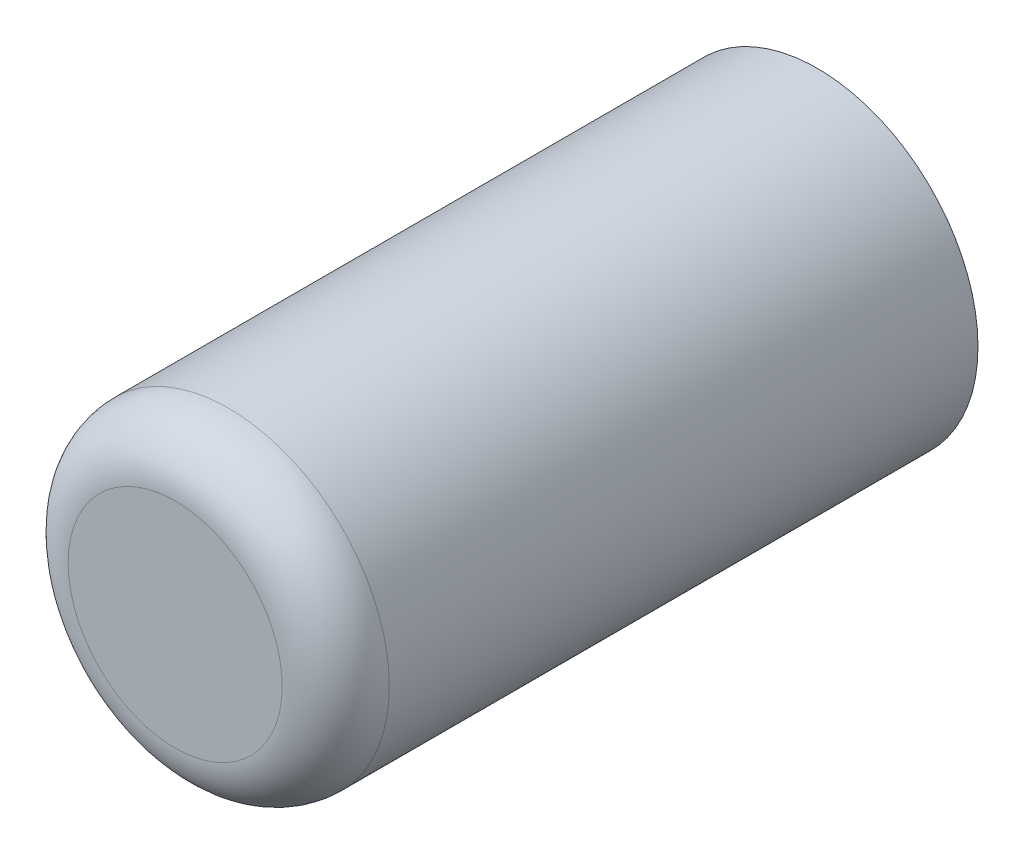
ISO-10303-21;
HEADER;
FILE_DESCRIPTION(('STEP AP214'),'2;1');
FILE_NAME('part.step','',(''),(''),'','','');
FILE_SCHEMA(('AUTOMOTIVE_DESIGN { 1 0 10303 214 1 1 1 1 }'));
ENDSEC;
DATA;
#1=APPLICATION_CONTEXT('core data for automotive mechanical design processes');
#2=APPLICATION_PROTOCOL_DEFINITION('international standard','automotive_design',2000,#1);
#3=PRODUCT_CONTEXT('',#1,'mechanical');
#4=PRODUCT('Part','Part','',(#3));
#5=PRODUCT_RELATED_PRODUCT_CATEGORY('part','',(#4));
#6=PRODUCT_DEFINITION_FORMATION('','',#4);
#7=PRODUCT_DEFINITION_CONTEXT('part definition',#1,'design');
#8=PRODUCT_DEFINITION('design','',#6,#7);
#9=PRODUCT_DEFINITION_SHAPE('','',#8);
#10=(LENGTH_UNIT() NAMED_UNIT(*) SI_UNIT(.MILLI.,.METRE.));
#11=(NAMED_UNIT(*) PLANE_ANGLE_UNIT() SI_UNIT($,.RADIAN.));
#12=(NAMED_UNIT(*) SI_UNIT($,.STERADIAN.) SOLID_ANGLE_UNIT());
#13=UNCERTAINTY_MEASURE_WITH_UNIT(LENGTH_MEASURE(1.E-05),#10,'distance_accuracy_value','');
#14=(GEOMETRIC_REPRESENTATION_CONTEXT(3) GLOBAL_UNCERTAINTY_ASSIGNED_CONTEXT((#13)) GLOBAL_UNIT_ASSIGNED_CONTEXT((#10,
#11,#12)) REPRESENTATION_CONTEXT('',''));
#15=CARTESIAN_POINT('',(0.,0.,0.));
#16=DIRECTION('',(0.,0.,1.));
#17=DIRECTION('',(1.,0.,0.));
#18=AXIS2_PLACEMENT_3D('',#15,#16,#17);
#19=CARTESIAN_POINT('',(0.,0.,12.));
#20=DIRECTION('',(0.,0.,-1.));
#21=DIRECTION('',(-1.,0.,0.));
#22=AXIS2_PLACEMENT_3D('',#19,#20,#21);
#23=CYLINDRICAL_SURFACE('',#22,3.);
#24=CARTESIAN_POINT('',(0.,0.,11.));
#25=DIRECTION('',(0.,0.,1.));
#26=DIRECTION('',(1.,0.,0.));
#27=AXIS2_PLACEMENT_3D('',#24,#25,#26);
#28=CIRCLE('',#27,3.);
#29=CARTESIAN_POINT('',(3.,0.,11.));
#30=VERTEX_POINT('',#29);
#31=EDGE_CURVE('E10',#30,#30,#28,.F.);
#32=ORIENTED_EDGE('',*,*,#31,.T.);
#33=EDGE_LOOP('',(#32));
#34=FACE_BOUND('',#33,.T.);
#35=CARTESIAN_POINT('',(0.,0.,0.));
#36=DIRECTION('',(0.,0.,1.));
#37=DIRECTION('',(1.,0.,0.));
#38=AXIS2_PLACEMENT_3D('',#35,#36,#37);
#39=CIRCLE('',#38,3.);
#40=CARTESIAN_POINT('',(3.,0.,0.));
#41=VERTEX_POINT('',#40);
#42=EDGE_CURVE('E44',#41,#41,#39,.T.);
#43=ORIENTED_EDGE('',*,*,#42,.T.);
#44=EDGE_LOOP('',(#43));
#45=FACE_BOUND('',#44,.T.);
#46=ADVANCED_FACE('F33',(#34,#45),#23,.T.);
#47=CARTESIAN_POINT('',(0.,0.,12.));
#48=DIRECTION('',(0.,0.,1.));
#49=DIRECTION('',(1.,0.,0.));
#50=AXIS2_PLACEMENT_3D('',#47,#48,#49);
#51=PLANE('',#50);
#52=CARTESIAN_POINT('',(0.,0.,12.));
#53=DIRECTION('',(0.,0.,1.));
#54=DIRECTION('',(1.,0.,0.));
#55=AXIS2_PLACEMENT_3D('',#52,#53,#54);
#56=CIRCLE('',#55,2.);
#57=CARTESIAN_POINT('',(2.,0.,12.));
#58=VERTEX_POINT('',#57);
#59=EDGE_CURVE('E40',#58,#58,#56,.T.);
#60=ORIENTED_EDGE('',*,*,#59,.T.);
#61=EDGE_LOOP('',(#60));
#62=FACE_BOUND('',#61,.T.);
#63=ADVANCED_FACE('F54',(#62),#51,.T.);
#64=CARTESIAN_POINT('',(0.,0.,0.));
#65=DIRECTION('',(0.,0.,1.));
#66=DIRECTION('',(1.,0.,0.));
#67=AXIS2_PLACEMENT_3D('',#64,#65,#66);
#68=PLANE('',#67);
#69=ORIENTED_EDGE('',*,*,#42,.F.);
#70=EDGE_LOOP('',(#69));
#71=FACE_BOUND('',#70,.T.);
#72=ADVANCED_FACE('F52',(#71),#68,.F.);
#73=CARTESIAN_POINT('',(0.,0.,11.));
#74=DIRECTION('',(0.,0.,1.));
#75=DIRECTION('',(1.,0.,0.));
#76=AXIS2_PLACEMENT_3D('',#73,#74,#75);
#77=TOROIDAL_SURFACE('',#76,2.,1.);
#78=ORIENTED_EDGE('',*,*,#31,.F.);
#79=EDGE_LOOP('',(#78));
#80=FACE_BOUND('',#79,.T.);
#81=ORIENTED_EDGE('',*,*,#59,.F.);
#82=EDGE_LOOP('',(#81));
#83=FACE_BOUND('',#82,.T.);
#84=ADVANCED_FACE('F35',(#80,#83),#77,.T.);
#85=CLOSED_SHELL('',(#46,#63,#72,#84));
#86=MANIFOLD_SOLID_BREP('B2',#85);
#87=ADVANCED_BREP_SHAPE_REPRESENTATION('',(#18,#86),#14);
#88=SHAPE_DEFINITION_REPRESENTATION(#9,#87);
ENDSEC;
END-ISO-10303-21;
